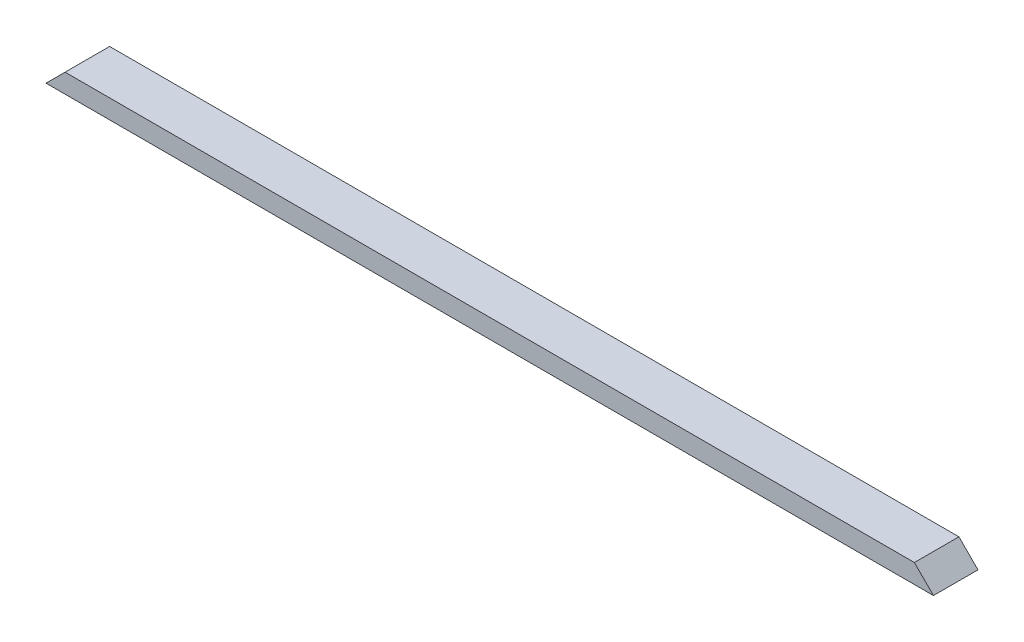
ISO-10303-21;
HEADER;
FILE_DESCRIPTION(('STEP AP214'),'2;1');
FILE_NAME('part.step','',(''),(''),'','','');
FILE_SCHEMA(('AUTOMOTIVE_DESIGN { 1 0 10303 214 1 1 1 1 }'));
ENDSEC;
DATA;
#1=APPLICATION_CONTEXT('core data for automotive mechanical design processes');
#2=APPLICATION_PROTOCOL_DEFINITION('international standard','automotive_design',2000,#1);
#3=PRODUCT_CONTEXT('',#1,'mechanical');
#4=PRODUCT('Part','Part','',(#3));
#5=PRODUCT_RELATED_PRODUCT_CATEGORY('part','',(#4));
#6=PRODUCT_DEFINITION_FORMATION('','',#4);
#7=PRODUCT_DEFINITION_CONTEXT('part definition',#1,'design');
#8=PRODUCT_DEFINITION('design','',#6,#7);
#9=PRODUCT_DEFINITION_SHAPE('','',#8);
#10=(LENGTH_UNIT() NAMED_UNIT(*) SI_UNIT(.MILLI.,.METRE.));
#11=(NAMED_UNIT(*) PLANE_ANGLE_UNIT() SI_UNIT($,.RADIAN.));
#12=(NAMED_UNIT(*) SI_UNIT($,.STERADIAN.) SOLID_ANGLE_UNIT());
#13=UNCERTAINTY_MEASURE_WITH_UNIT(LENGTH_MEASURE(1.E-05),#10,'distance_accuracy_value','');
#14=(GEOMETRIC_REPRESENTATION_CONTEXT(3) GLOBAL_UNCERTAINTY_ASSIGNED_CONTEXT((#13)) GLOBAL_UNIT_ASSIGNED_CONTEXT((#10,
#11,#12)) REPRESENTATION_CONTEXT('',''));
#15=CARTESIAN_POINT('',(0.,0.,0.));
#16=DIRECTION('',(0.,0.,1.));
#17=DIRECTION('',(1.,0.,0.));
#18=AXIS2_PLACEMENT_3D('',#15,#16,#17);
#19=CARTESIAN_POINT('',(0.,38.1,0.));
#20=DIRECTION('',(0.,0.,-1.));
#21=DIRECTION('',(-1.,0.,0.));
#22=AXIS2_PLACEMENT_3D('',#19,#20,#21);
#23=PLANE('',#22);
#24=DIRECTION('',(1.,0.,0.));
#25=VECTOR('',#24,1.);
#26=CARTESIAN_POINT('',(0.,38.1,0.));
#27=LINE('',#26,#25);
#28=CARTESIAN_POINT('',(38.1,38.1,0.));
#29=VERTEX_POINT('',#28);
#30=CARTESIAN_POINT('',(1733.55,38.1000000000001,0.));
#31=VERTEX_POINT('',#30);
#32=EDGE_CURVE('E51',#29,#31,#27,.T.);
#33=ORIENTED_EDGE('',*,*,#32,.F.);
#34=DIRECTION('',(0.707106781186547,0.707106781186547,0.));
#35=VECTOR('',#34,1.);
#36=CARTESIAN_POINT('',(0.,0.,0.));
#37=LINE('',#36,#35);
#38=CARTESIAN_POINT('',(0.,0.,0.));
#39=VERTEX_POINT('',#38);
#40=EDGE_CURVE('E86',#39,#29,#37,.T.);
#41=ORIENTED_EDGE('',*,*,#40,.F.);
#42=DIRECTION('',(1.,0.,0.));
#43=VECTOR('',#42,1.);
#44=CARTESIAN_POINT('',(0.,0.,0.));
#45=LINE('',#44,#43);
#46=CARTESIAN_POINT('',(1771.65,0.,0.));
#47=VERTEX_POINT('',#46);
#48=EDGE_CURVE('E92',#39,#47,#45,.T.);
#49=ORIENTED_EDGE('',*,*,#48,.T.);
#50=DIRECTION('',(0.707106781186547,-0.707106781186548,0.));
#51=VECTOR('',#50,1.);
#52=CARTESIAN_POINT('',(1733.55,38.1000000000001,0.));
#53=LINE('',#52,#51);
#54=EDGE_CURVE('E67',#31,#47,#53,.T.);
#55=ORIENTED_EDGE('',*,*,#54,.F.);
#56=EDGE_LOOP('',(#33,#41,#49,#55));
#57=FACE_BOUND('',#56,.T.);
#58=ADVANCED_FACE('F42',(#57),#23,.F.);
#59=CARTESIAN_POINT('',(0.,38.1,-88.9));
#60=DIRECTION('',(0.,0.,1.));
#61=DIRECTION('',(1.,0.,0.));
#62=AXIS2_PLACEMENT_3D('',#59,#60,#61);
#63=PLANE('',#62);
#64=DIRECTION('',(-1.,0.,0.));
#65=VECTOR('',#64,1.);
#66=CARTESIAN_POINT('',(0.,0.,-88.9));
#67=LINE('',#66,#65);
#68=CARTESIAN_POINT('',(1771.65,0.,-88.9));
#69=VERTEX_POINT('',#68);
#70=CARTESIAN_POINT('',(0.,0.,-88.9));
#71=VERTEX_POINT('',#70);
#72=EDGE_CURVE('E45',#69,#71,#67,.T.);
#73=ORIENTED_EDGE('',*,*,#72,.T.);
#74=DIRECTION('',(0.707106781186547,0.707106781186547,0.));
#75=VECTOR('',#74,1.);
#76=CARTESIAN_POINT('',(0.,0.,-88.9));
#77=LINE('',#76,#75);
#78=CARTESIAN_POINT('',(38.1,38.1,-88.9));
#79=VERTEX_POINT('',#78);
#80=EDGE_CURVE('E59',#71,#79,#77,.T.);
#81=ORIENTED_EDGE('',*,*,#80,.T.);
#82=DIRECTION('',(-1.,0.,0.));
#83=VECTOR('',#82,1.);
#84=CARTESIAN_POINT('',(0.,38.1,-88.9));
#85=LINE('',#84,#83);
#86=CARTESIAN_POINT('',(1733.55,38.1000000000001,-88.9));
#87=VERTEX_POINT('',#86);
#88=EDGE_CURVE('E11',#87,#79,#85,.T.);
#89=ORIENTED_EDGE('',*,*,#88,.F.);
#90=DIRECTION('',(0.707106781186547,-0.707106781186548,0.));
#91=VECTOR('',#90,1.);
#92=CARTESIAN_POINT('',(1733.55,38.1000000000001,-88.9));
#93=LINE('',#92,#91);
#94=EDGE_CURVE('E110',#87,#69,#93,.T.);
#95=ORIENTED_EDGE('',*,*,#94,.T.);
#96=EDGE_LOOP('',(#73,#81,#89,#95));
#97=FACE_BOUND('',#96,.T.);
#98=ADVANCED_FACE('F125',(#97),#63,.F.);
#99=CARTESIAN_POINT('',(0.,38.1,0.));
#100=DIRECTION('',(0.,-1.,0.));
#101=DIRECTION('',(0.,0.,-1.));
#102=AXIS2_PLACEMENT_3D('',#99,#100,#101);
#103=PLANE('',#102);
#104=ORIENTED_EDGE('',*,*,#88,.T.);
#105=DIRECTION('',(0.,0.,1.));
#106=VECTOR('',#105,1.);
#107=CARTESIAN_POINT('',(38.1,38.1,-88.9));
#108=LINE('',#107,#106);
#109=EDGE_CURVE('E93',#79,#29,#108,.T.);
#110=ORIENTED_EDGE('',*,*,#109,.T.);
#111=ORIENTED_EDGE('',*,*,#32,.T.);
#112=DIRECTION('',(0.,0.,1.));
#113=VECTOR('',#112,1.);
#114=CARTESIAN_POINT('',(1733.55,38.1000000000001,-88.9));
#115=LINE('',#114,#113);
#116=EDGE_CURVE('E114',#87,#31,#115,.T.);
#117=ORIENTED_EDGE('',*,*,#116,.F.);
#118=EDGE_LOOP('',(#104,#110,#111,#117));
#119=FACE_BOUND('',#118,.T.);
#120=ADVANCED_FACE('F128',(#119),#103,.F.);
#121=CARTESIAN_POINT('',(0.,0.,0.));
#122=DIRECTION('',(0.,-1.,0.));
#123=DIRECTION('',(0.,0.,-1.));
#124=AXIS2_PLACEMENT_3D('',#121,#122,#123);
#125=PLANE('',#124);
#126=DIRECTION('',(0.,0.,1.));
#127=VECTOR('',#126,1.);
#128=CARTESIAN_POINT('',(0.,0.,0.));
#129=LINE('',#128,#127);
#130=EDGE_CURVE('E83',#71,#39,#129,.T.);
#131=ORIENTED_EDGE('',*,*,#130,.F.);
#132=ORIENTED_EDGE('',*,*,#72,.F.);
#133=DIRECTION('',(0.,0.,-1.));
#134=VECTOR('',#133,1.);
#135=CARTESIAN_POINT('',(1771.65,0.,0.));
#136=LINE('',#135,#134);
#137=EDGE_CURVE('E102',#47,#69,#136,.T.);
#138=ORIENTED_EDGE('',*,*,#137,.F.);
#139=ORIENTED_EDGE('',*,*,#48,.F.);
#140=EDGE_LOOP('',(#131,#132,#138,#139));
#141=FACE_BOUND('',#140,.T.);
#142=ADVANCED_FACE('F101',(#141),#125,.T.);
#143=CARTESIAN_POINT('',(1733.55,38.1000000000001,-88.9));
#144=DIRECTION('',(-0.707106781186548,-0.707106781186547,0.));
#145=DIRECTION('',(0.707106781186547,-0.707106781186548,0.));
#146=AXIS2_PLACEMENT_3D('',#143,#144,#145);
#147=PLANE('',#146);
#148=ORIENTED_EDGE('',*,*,#54,.T.);
#149=ORIENTED_EDGE('',*,*,#137,.T.);
#150=ORIENTED_EDGE('',*,*,#94,.F.);
#151=ORIENTED_EDGE('',*,*,#116,.T.);
#152=EDGE_LOOP('',(#148,#149,#150,#151));
#153=FACE_BOUND('',#152,.T.);
#154=ADVANCED_FACE('F129',(#153),#147,.F.);
#155=CARTESIAN_POINT('',(0.,0.,-88.9));
#156=DIRECTION('',(0.707106781186547,-0.707106781186547,0.));
#157=DIRECTION('',(0.707106781186548,0.707106781186548,0.));
#158=AXIS2_PLACEMENT_3D('',#155,#156,#157);
#159=PLANE('',#158);
#160=ORIENTED_EDGE('',*,*,#40,.T.);
#161=ORIENTED_EDGE('',*,*,#109,.F.);
#162=ORIENTED_EDGE('',*,*,#80,.F.);
#163=ORIENTED_EDGE('',*,*,#130,.T.);
#164=EDGE_LOOP('',(#160,#161,#162,#163));
#165=FACE_BOUND('',#164,.T.);
#166=ADVANCED_FACE('F85',(#165),#159,.F.);
#167=CLOSED_SHELL('',(#58,#98,#120,#142,#154,#166));
#168=MANIFOLD_SOLID_BREP('B2',#167);
#169=ADVANCED_BREP_SHAPE_REPRESENTATION('',(#18,#168),#14);
#170=SHAPE_DEFINITION_REPRESENTATION(#9,#169);
ENDSEC;
END-ISO-10303-21;
